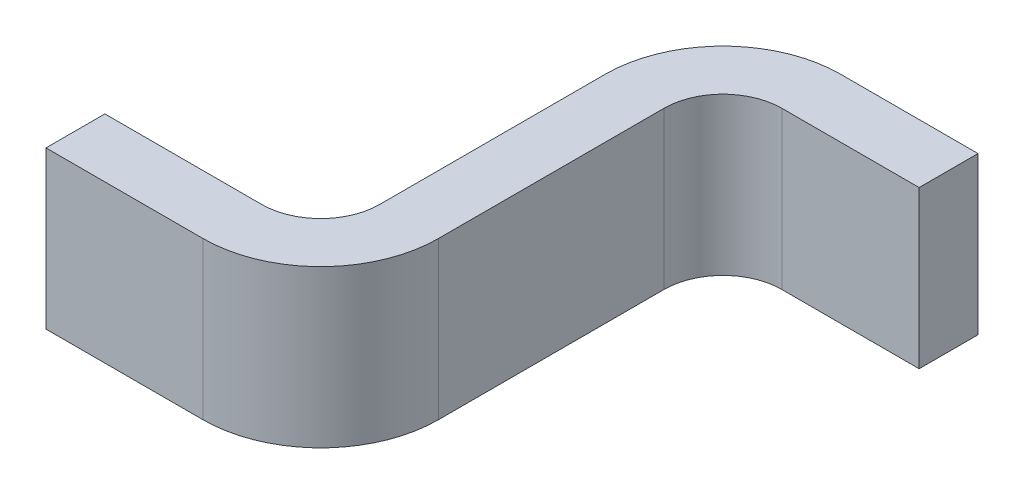
ISO-10303-21;
HEADER;
FILE_DESCRIPTION(('STEP AP214'),'2;1');
FILE_NAME('part.step','',(''),(''),'','','');
FILE_SCHEMA(('AUTOMOTIVE_DESIGN { 1 0 10303 214 1 1 1 1 }'));
ENDSEC;
DATA;
#1=APPLICATION_CONTEXT('core data for automotive mechanical design processes');
#2=APPLICATION_PROTOCOL_DEFINITION('international standard','automotive_design',2000,#1);
#3=PRODUCT_CONTEXT('',#1,'mechanical');
#4=PRODUCT('Part','Part','',(#3));
#5=PRODUCT_RELATED_PRODUCT_CATEGORY('part','',(#4));
#6=PRODUCT_DEFINITION_FORMATION('','',#4);
#7=PRODUCT_DEFINITION_CONTEXT('part definition',#1,'design');
#8=PRODUCT_DEFINITION('design','',#6,#7);
#9=PRODUCT_DEFINITION_SHAPE('','',#8);
#10=(LENGTH_UNIT() NAMED_UNIT(*) SI_UNIT(.MILLI.,.METRE.));
#11=(NAMED_UNIT(*) PLANE_ANGLE_UNIT() SI_UNIT($,.RADIAN.));
#12=(NAMED_UNIT(*) SI_UNIT($,.STERADIAN.) SOLID_ANGLE_UNIT());
#13=UNCERTAINTY_MEASURE_WITH_UNIT(LENGTH_MEASURE(1.E-05),#10,'distance_accuracy_value','');
#14=(GEOMETRIC_REPRESENTATION_CONTEXT(3) GLOBAL_UNCERTAINTY_ASSIGNED_CONTEXT((#13)) GLOBAL_UNIT_ASSIGNED_CONTEXT((#10,
#11,#12)) REPRESENTATION_CONTEXT('',''));
#15=CARTESIAN_POINT('',(0.,0.,0.));
#16=DIRECTION('',(0.,0.,1.));
#17=DIRECTION('',(1.,0.,0.));
#18=AXIS2_PLACEMENT_3D('',#15,#16,#17);
#19=CARTESIAN_POINT('',(3.15,-1.07,0.));
#20=DIRECTION('',(0.,1.,0.));
#21=DIRECTION('',(1.,0.,0.));
#22=AXIS2_PLACEMENT_3D('',#19,#20,#21);
#23=PLANE('',#22);
#24=CARTESIAN_POINT('',(3.05,-1.07,0.3));
#25=DIRECTION('',(0.,-1.,0.));
#26=DIRECTION('',(0.,0.,-1.));
#27=AXIS2_PLACEMENT_3D('',#24,#25,#26);
#28=CIRCLE('',#27,0.15);
#29=CARTESIAN_POINT('',(2.9,-1.07,0.3));
#30=VERTEX_POINT('',#29);
#31=CARTESIAN_POINT('',(3.05,-1.07,0.15));
#32=VERTEX_POINT('',#31);
#33=EDGE_CURVE('E209',#30,#32,#28,.T.);
#34=ORIENTED_EDGE('',*,*,#33,.T.);
#35=DIRECTION('',(-1.,0.,0.));
#36=VECTOR('',#35,1.);
#37=CARTESIAN_POINT('',(0.,-1.07,0.15));
#38=LINE('',#37,#36);
#39=CARTESIAN_POINT('',(3.4,-1.07,0.15));
#40=VERTEX_POINT('',#39);
#41=EDGE_CURVE('E250',#40,#32,#38,.T.);
#42=ORIENTED_EDGE('',*,*,#41,.F.);
#43=DIRECTION('',(0.,0.,1.));
#44=VECTOR('',#43,1.);
#45=CARTESIAN_POINT('',(3.4,-1.07,0.));
#46=LINE('',#45,#44);
#47=CARTESIAN_POINT('',(3.4,-1.07,0.));
#48=VERTEX_POINT('',#47);
#49=EDGE_CURVE('E163',#48,#40,#46,.T.);
#50=ORIENTED_EDGE('',*,*,#49,.F.);
#51=DIRECTION('',(-1.,0.,0.));
#52=VECTOR('',#51,1.);
#53=CARTESIAN_POINT('',(-2.475,-1.07,0.));
#54=LINE('',#53,#52);
#55=CARTESIAN_POINT('',(3.05,-1.07,0.));
#56=VERTEX_POINT('',#55);
#57=EDGE_CURVE('E273',#48,#56,#54,.T.);
#58=ORIENTED_EDGE('',*,*,#57,.T.);
#59=CARTESIAN_POINT('',(3.05,-1.07,0.3));
#60=DIRECTION('',(0.,-1.,0.));
#61=DIRECTION('',(0.,0.,-1.));
#62=AXIS2_PLACEMENT_3D('',#59,#60,#61);
#63=CIRCLE('',#62,0.3);
#64=CARTESIAN_POINT('',(2.75,-1.07,0.3));
#65=VERTEX_POINT('',#64);
#66=EDGE_CURVE('E20',#65,#56,#63,.T.);
#67=ORIENTED_EDGE('',*,*,#66,.F.);
#68=DIRECTION('',(0.,0.,-1.));
#69=VECTOR('',#68,1.);
#70=CARTESIAN_POINT('',(2.75,-1.07,1.175));
#71=LINE('',#70,#69);
#72=CARTESIAN_POINT('',(2.75,-1.07,0.875));
#73=VERTEX_POINT('',#72);
#74=EDGE_CURVE('E188',#73,#65,#71,.T.);
#75=ORIENTED_EDGE('',*,*,#74,.F.);
#76=CARTESIAN_POINT('',(2.6,-1.07,0.875));
#77=DIRECTION('',(0.,-1.,0.));
#78=DIRECTION('',(0.,0.,1.));
#79=AXIS2_PLACEMENT_3D('',#76,#77,#78);
#80=CIRCLE('',#79,0.15);
#81=CARTESIAN_POINT('',(2.6,-1.07,1.025));
#82=VERTEX_POINT('',#81);
#83=EDGE_CURVE('E183',#73,#82,#80,.T.);
#84=ORIENTED_EDGE('',*,*,#83,.T.);
#85=DIRECTION('',(-1.,0.,0.));
#86=VECTOR('',#85,1.);
#87=CARTESIAN_POINT('',(0.,-1.07,1.025));
#88=LINE('',#87,#86);
#89=CARTESIAN_POINT('',(2.2,-1.07,1.025));
#90=VERTEX_POINT('',#89);
#91=EDGE_CURVE('E239',#82,#90,#88,.T.);
#92=ORIENTED_EDGE('',*,*,#91,.T.);
#93=DIRECTION('',(0.,0.,-1.));
#94=VECTOR('',#93,1.);
#95=CARTESIAN_POINT('',(2.2,-1.07,1.1));
#96=LINE('',#95,#94);
#97=CARTESIAN_POINT('',(2.2,-1.07,1.175));
#98=VERTEX_POINT('',#97);
#99=EDGE_CURVE('E27',#98,#90,#96,.T.);
#100=ORIENTED_EDGE('',*,*,#99,.F.);
#101=DIRECTION('',(-1.,0.,0.));
#102=VECTOR('',#101,1.);
#103=CARTESIAN_POINT('',(0.,-1.07,1.175));
#104=LINE('',#103,#102);
#105=CARTESIAN_POINT('',(2.6,-1.07,1.175));
#106=VERTEX_POINT('',#105);
#107=EDGE_CURVE('E11',#106,#98,#104,.T.);
#108=ORIENTED_EDGE('',*,*,#107,.F.);
#109=CARTESIAN_POINT('',(2.6,-1.07,0.875));
#110=DIRECTION('',(0.,-1.,0.));
#111=DIRECTION('',(0.,0.,-1.));
#112=AXIS2_PLACEMENT_3D('',#109,#110,#111);
#113=CIRCLE('',#112,0.3);
#114=CARTESIAN_POINT('',(2.9,-1.07,0.875));
#115=VERTEX_POINT('',#114);
#116=EDGE_CURVE('E135',#115,#106,#113,.T.);
#117=ORIENTED_EDGE('',*,*,#116,.F.);
#118=DIRECTION('',(0.,0.,1.));
#119=VECTOR('',#118,1.);
#120=CARTESIAN_POINT('',(2.9,-1.07,1.175));
#121=LINE('',#120,#119);
#122=EDGE_CURVE('E202',#30,#115,#121,.T.);
#123=ORIENTED_EDGE('',*,*,#122,.F.);
#124=EDGE_LOOP('',(#34,#42,#50,#58,#67,#75,#84,#92,#100,#108,#117,#123));
#125=FACE_BOUND('',#124,.T.);
#126=ADVANCED_FACE('F16',(#125),#23,.T.);
#127=CARTESIAN_POINT('',(0.,0.,1.175));
#128=DIRECTION('',(0.,0.,1.));
#129=DIRECTION('',(1.,0.,0.));
#130=AXIS2_PLACEMENT_3D('',#127,#128,#129);
#131=PLANE('',#130);
#132=DIRECTION('',(0.,1.,0.));
#133=VECTOR('',#132,1.);
#134=CARTESIAN_POINT('',(2.2,-1.27,1.175));
#135=LINE('',#134,#133);
#136=CARTESIAN_POINT('',(2.2,-1.47,1.175));
#137=VERTEX_POINT('',#136);
#138=EDGE_CURVE('E142',#137,#98,#135,.T.);
#139=ORIENTED_EDGE('',*,*,#138,.F.);
#140=DIRECTION('',(-1.,0.,0.));
#141=VECTOR('',#140,1.);
#142=CARTESIAN_POINT('',(2.825,-1.47,1.175));
#143=LINE('',#142,#141);
#144=CARTESIAN_POINT('',(2.6,-1.47,1.175));
#145=VERTEX_POINT('',#144);
#146=EDGE_CURVE('E140',#145,#137,#143,.T.);
#147=ORIENTED_EDGE('',*,*,#146,.F.);
#148=DIRECTION('',(0.,1.,0.));
#149=VECTOR('',#148,1.);
#150=CARTESIAN_POINT('',(2.6,0.,1.175));
#151=LINE('',#150,#149);
#152=EDGE_CURVE('E127',#145,#106,#151,.T.);
#153=ORIENTED_EDGE('',*,*,#152,.T.);
#154=ORIENTED_EDGE('',*,*,#107,.T.);
#155=EDGE_LOOP('',(#139,#147,#153,#154));
#156=FACE_BOUND('',#155,.T.);
#157=ADVANCED_FACE('F18',(#156),#131,.T.);
#158=CARTESIAN_POINT('',(2.2,-1.27,1.1));
#159=DIRECTION('',(-1.,0.,0.));
#160=DIRECTION('',(0.,0.,1.));
#161=AXIS2_PLACEMENT_3D('',#158,#159,#160);
#162=PLANE('',#161);
#163=ORIENTED_EDGE('',*,*,#138,.T.);
#164=ORIENTED_EDGE('',*,*,#99,.T.);
#165=DIRECTION('',(0.,-1.,0.));
#166=VECTOR('',#165,1.);
#167=CARTESIAN_POINT('',(2.2,0.,1.025));
#168=LINE('',#167,#166);
#169=CARTESIAN_POINT('',(2.2,-1.47,1.025));
#170=VERTEX_POINT('',#169);
#171=EDGE_CURVE('E236',#90,#170,#168,.T.);
#172=ORIENTED_EDGE('',*,*,#171,.T.);
#173=DIRECTION('',(0.,0.,-1.));
#174=VECTOR('',#173,1.);
#175=CARTESIAN_POINT('',(2.2,-1.47,1.175));
#176=LINE('',#175,#174);
#177=EDGE_CURVE('E147',#137,#170,#176,.T.);
#178=ORIENTED_EDGE('',*,*,#177,.F.);
#179=EDGE_LOOP('',(#163,#164,#172,#178));
#180=FACE_BOUND('',#179,.T.);
#181=ADVANCED_FACE('F387',(#180),#162,.T.);
#182=CARTESIAN_POINT('',(0.,0.,1.025));
#183=DIRECTION('',(0.,0.,1.));
#184=DIRECTION('',(1.,0.,0.));
#185=AXIS2_PLACEMENT_3D('',#182,#183,#184);
#186=PLANE('',#185);
#187=DIRECTION('',(1.,0.,0.));
#188=VECTOR('',#187,1.);
#189=CARTESIAN_POINT('',(2.825,-1.47,1.025));
#190=LINE('',#189,#188);
#191=CARTESIAN_POINT('',(2.6,-1.47,1.025));
#192=VERTEX_POINT('',#191);
#193=EDGE_CURVE('E172',#170,#192,#190,.T.);
#194=ORIENTED_EDGE('',*,*,#193,.F.);
#195=ORIENTED_EDGE('',*,*,#171,.F.);
#196=ORIENTED_EDGE('',*,*,#91,.F.);
#197=DIRECTION('',(0.,-1.,0.));
#198=VECTOR('',#197,1.);
#199=CARTESIAN_POINT('',(2.6,-0.635,1.025));
#200=LINE('',#199,#198);
#201=EDGE_CURVE('E187',#82,#192,#200,.T.);
#202=ORIENTED_EDGE('',*,*,#201,.T.);
#203=EDGE_LOOP('',(#194,#195,#196,#202));
#204=FACE_BOUND('',#203,.T.);
#205=ADVANCED_FACE('F355',(#204),#186,.F.);
#206=CARTESIAN_POINT('',(2.6,-0.635,0.875));
#207=DIRECTION('',(0.,1.,0.));
#208=DIRECTION('',(0.,0.,1.));
#209=AXIS2_PLACEMENT_3D('',#206,#207,#208);
#210=CYLINDRICAL_SURFACE('',#209,0.15);
#211=ORIENTED_EDGE('',*,*,#83,.F.);
#212=DIRECTION('',(0.,1.,0.));
#213=VECTOR('',#212,1.);
#214=CARTESIAN_POINT('',(2.75,-1.27,0.875));
#215=LINE('',#214,#213);
#216=CARTESIAN_POINT('',(2.75,-1.47,0.875));
#217=VERTEX_POINT('',#216);
#218=EDGE_CURVE('E230',#217,#73,#215,.T.);
#219=ORIENTED_EDGE('',*,*,#218,.F.);
#220=CARTESIAN_POINT('',(2.6,-1.47,0.875));
#221=DIRECTION('',(0.,1.,0.));
#222=DIRECTION('',(0.,0.,1.));
#223=AXIS2_PLACEMENT_3D('',#220,#221,#222);
#224=CIRCLE('',#223,0.15);
#225=EDGE_CURVE('E198',#192,#217,#224,.T.);
#226=ORIENTED_EDGE('',*,*,#225,.F.);
#227=ORIENTED_EDGE('',*,*,#201,.F.);
#228=EDGE_LOOP('',(#211,#219,#226,#227));
#229=FACE_BOUND('',#228,.T.);
#230=ADVANCED_FACE('F351',(#229),#210,.F.);
#231=CARTESIAN_POINT('',(2.75,-1.27,1.175));
#232=DIRECTION('',(-1.,0.,0.));
#233=DIRECTION('',(0.,0.,1.));
#234=AXIS2_PLACEMENT_3D('',#231,#232,#233);
#235=PLANE('',#234);
#236=ORIENTED_EDGE('',*,*,#218,.T.);
#237=ORIENTED_EDGE('',*,*,#74,.T.);
#238=DIRECTION('',(0.,1.,0.));
#239=VECTOR('',#238,1.);
#240=CARTESIAN_POINT('',(2.75,0.,0.3));
#241=LINE('',#240,#239);
#242=CARTESIAN_POINT('',(2.75,-1.47,0.3));
#243=VERTEX_POINT('',#242);
#244=EDGE_CURVE('E173',#243,#65,#241,.T.);
#245=ORIENTED_EDGE('',*,*,#244,.F.);
#246=DIRECTION('',(0.,0.,-1.));
#247=VECTOR('',#246,1.);
#248=CARTESIAN_POINT('',(2.75,-1.47,1.175));
#249=LINE('',#248,#247);
#250=EDGE_CURVE('E223',#217,#243,#249,.T.);
#251=ORIENTED_EDGE('',*,*,#250,.F.);
#252=EDGE_LOOP('',(#236,#237,#245,#251));
#253=FACE_BOUND('',#252,.T.);
#254=ADVANCED_FACE('F323',(#253),#235,.T.);
#255=CARTESIAN_POINT('',(3.05,0.,0.3));
#256=DIRECTION('',(0.,-1.,0.));
#257=DIRECTION('',(0.,0.,-1.));
#258=AXIS2_PLACEMENT_3D('',#255,#256,#257);
#259=CYLINDRICAL_SURFACE('',#258,0.3);
#260=DIRECTION('',(0.,-1.,0.));
#261=VECTOR('',#260,1.);
#262=CARTESIAN_POINT('',(3.05,1.27,0.));
#263=LINE('',#262,#261);
#264=CARTESIAN_POINT('',(3.05,-1.47,0.));
#265=VERTEX_POINT('',#264);
#266=EDGE_CURVE('E177',#56,#265,#263,.T.);
#267=ORIENTED_EDGE('',*,*,#266,.T.);
#268=CARTESIAN_POINT('',(3.05,-1.47,0.3));
#269=DIRECTION('',(0.,-1.,0.));
#270=DIRECTION('',(0.,0.,-1.));
#271=AXIS2_PLACEMENT_3D('',#268,#269,#270);
#272=CIRCLE('',#271,0.3);
#273=EDGE_CURVE('E225',#243,#265,#272,.T.);
#274=ORIENTED_EDGE('',*,*,#273,.F.);
#275=ORIENTED_EDGE('',*,*,#244,.T.);
#276=ORIENTED_EDGE('',*,*,#66,.T.);
#277=EDGE_LOOP('',(#267,#274,#275,#276));
#278=FACE_BOUND('',#277,.T.);
#279=ADVANCED_FACE('F297',(#278),#259,.T.);
#280=CARTESIAN_POINT('',(-2.475,1.27,0.));
#281=DIRECTION('',(0.,0.,1.));
#282=DIRECTION('',(1.,0.,0.));
#283=AXIS2_PLACEMENT_3D('',#280,#281,#282);
#284=PLANE('',#283);
#285=ORIENTED_EDGE('',*,*,#57,.F.);
#286=DIRECTION('',(0.,1.,0.));
#287=VECTOR('',#286,1.);
#288=CARTESIAN_POINT('',(3.4,-1.27,0.));
#289=LINE('',#288,#287);
#290=CARTESIAN_POINT('',(3.4,-1.47,0.));
#291=VERTEX_POINT('',#290);
#292=EDGE_CURVE('E222',#291,#48,#289,.T.);
#293=ORIENTED_EDGE('',*,*,#292,.F.);
#294=DIRECTION('',(1.,0.,0.));
#295=VECTOR('',#294,1.);
#296=CARTESIAN_POINT('',(2.825,-1.47,0.));
#297=LINE('',#296,#295);
#298=EDGE_CURVE('E169',#265,#291,#297,.T.);
#299=ORIENTED_EDGE('',*,*,#298,.F.);
#300=ORIENTED_EDGE('',*,*,#266,.F.);
#301=EDGE_LOOP('',(#285,#293,#299,#300));
#302=FACE_BOUND('',#301,.T.);
#303=ADVANCED_FACE('F295',(#302),#284,.F.);
#304=CARTESIAN_POINT('',(3.4,-1.27,0.));
#305=DIRECTION('',(1.,0.,0.));
#306=DIRECTION('',(0.,1.,0.));
#307=AXIS2_PLACEMENT_3D('',#304,#305,#306);
#308=PLANE('',#307);
#309=ORIENTED_EDGE('',*,*,#292,.T.);
#310=ORIENTED_EDGE('',*,*,#49,.T.);
#311=DIRECTION('',(0.,1.,0.));
#312=VECTOR('',#311,1.);
#313=CARTESIAN_POINT('',(3.4,0.,0.15));
#314=LINE('',#313,#312);
#315=CARTESIAN_POINT('',(3.4,-1.47,0.15));
#316=VERTEX_POINT('',#315);
#317=EDGE_CURVE('E229',#316,#40,#314,.T.);
#318=ORIENTED_EDGE('',*,*,#317,.F.);
#319=DIRECTION('',(0.,0.,1.));
#320=VECTOR('',#319,1.);
#321=CARTESIAN_POINT('',(3.4,-1.47,1.175));
#322=LINE('',#321,#320);
#323=EDGE_CURVE('E165',#291,#316,#322,.T.);
#324=ORIENTED_EDGE('',*,*,#323,.F.);
#325=EDGE_LOOP('',(#309,#310,#318,#324));
#326=FACE_BOUND('',#325,.T.);
#327=ADVANCED_FACE('F284',(#326),#308,.T.);
#328=CARTESIAN_POINT('',(0.,0.,0.15));
#329=DIRECTION('',(0.,0.,1.));
#330=DIRECTION('',(1.,0.,0.));
#331=AXIS2_PLACEMENT_3D('',#328,#329,#330);
#332=PLANE('',#331);
#333=ORIENTED_EDGE('',*,*,#317,.T.);
#334=ORIENTED_EDGE('',*,*,#41,.T.);
#335=DIRECTION('',(0.,-1.,0.));
#336=VECTOR('',#335,1.);
#337=CARTESIAN_POINT('',(3.05,-0.635,0.15));
#338=LINE('',#337,#336);
#339=CARTESIAN_POINT('',(3.05,-1.47,0.15));
#340=VERTEX_POINT('',#339);
#341=EDGE_CURVE('E218',#32,#340,#338,.T.);
#342=ORIENTED_EDGE('',*,*,#341,.T.);
#343=DIRECTION('',(-1.,0.,0.));
#344=VECTOR('',#343,1.);
#345=CARTESIAN_POINT('',(2.825,-1.47,0.15));
#346=LINE('',#345,#344);
#347=EDGE_CURVE('E168',#316,#340,#346,.T.);
#348=ORIENTED_EDGE('',*,*,#347,.F.);
#349=EDGE_LOOP('',(#333,#334,#342,#348));
#350=FACE_BOUND('',#349,.T.);
#351=ADVANCED_FACE('F290',(#350),#332,.T.);
#352=CARTESIAN_POINT('',(3.05,-0.635,0.3));
#353=DIRECTION('',(0.,-1.,0.));
#354=DIRECTION('',(0.,0.,-1.));
#355=AXIS2_PLACEMENT_3D('',#352,#353,#354);
#356=CYLINDRICAL_SURFACE('',#355,0.15);
#357=ORIENTED_EDGE('',*,*,#33,.F.);
#358=DIRECTION('',(0.,1.,0.));
#359=VECTOR('',#358,1.);
#360=CARTESIAN_POINT('',(2.9,-1.27,0.3));
#361=LINE('',#360,#359);
#362=CARTESIAN_POINT('',(2.9,-1.47,0.3));
#363=VERTEX_POINT('',#362);
#364=EDGE_CURVE('E137',#363,#30,#361,.T.);
#365=ORIENTED_EDGE('',*,*,#364,.F.);
#366=CARTESIAN_POINT('',(3.05,-1.47,0.3));
#367=DIRECTION('',(0.,1.,0.));
#368=DIRECTION('',(0.,0.,-1.));
#369=AXIS2_PLACEMENT_3D('',#366,#367,#368);
#370=CIRCLE('',#369,0.15);
#371=EDGE_CURVE('E192',#340,#363,#370,.T.);
#372=ORIENTED_EDGE('',*,*,#371,.F.);
#373=ORIENTED_EDGE('',*,*,#341,.F.);
#374=EDGE_LOOP('',(#357,#365,#372,#373));
#375=FACE_BOUND('',#374,.T.);
#376=ADVANCED_FACE('F288',(#375),#356,.F.);
#377=CARTESIAN_POINT('',(2.9,-1.27,1.175));
#378=DIRECTION('',(1.,0.,0.));
#379=DIRECTION('',(0.,1.,0.));
#380=AXIS2_PLACEMENT_3D('',#377,#378,#379);
#381=PLANE('',#380);
#382=DIRECTION('',(0.,1.,0.));
#383=VECTOR('',#382,1.);
#384=CARTESIAN_POINT('',(2.9,-0.635,0.875));
#385=LINE('',#384,#383);
#386=CARTESIAN_POINT('',(2.9,-1.47,0.875));
#387=VERTEX_POINT('',#386);
#388=EDGE_CURVE('E180',#387,#115,#385,.T.);
#389=ORIENTED_EDGE('',*,*,#388,.F.);
#390=DIRECTION('',(0.,0.,1.));
#391=VECTOR('',#390,1.);
#392=CARTESIAN_POINT('',(2.9,-1.47,1.175));
#393=LINE('',#392,#391);
#394=EDGE_CURVE('E152',#363,#387,#393,.T.);
#395=ORIENTED_EDGE('',*,*,#394,.F.);
#396=ORIENTED_EDGE('',*,*,#364,.T.);
#397=ORIENTED_EDGE('',*,*,#122,.T.);
#398=EDGE_LOOP('',(#389,#395,#396,#397));
#399=FACE_BOUND('',#398,.T.);
#400=ADVANCED_FACE('F311',(#399),#381,.T.);
#401=CARTESIAN_POINT('',(2.6,-0.635,0.875));
#402=DIRECTION('',(0.,-1.,0.));
#403=DIRECTION('',(0.,0.,-1.));
#404=AXIS2_PLACEMENT_3D('',#401,#402,#403);
#405=CYLINDRICAL_SURFACE('',#404,0.3);
#406=ORIENTED_EDGE('',*,*,#388,.T.);
#407=ORIENTED_EDGE('',*,*,#116,.T.);
#408=ORIENTED_EDGE('',*,*,#152,.F.);
#409=CARTESIAN_POINT('',(2.6,-1.47,0.875));
#410=DIRECTION('',(0.,-1.,0.));
#411=DIRECTION('',(0.,0.,-1.));
#412=AXIS2_PLACEMENT_3D('',#409,#410,#411);
#413=CIRCLE('',#412,0.3);
#414=EDGE_CURVE('E132',#387,#145,#413,.T.);
#415=ORIENTED_EDGE('',*,*,#414,.F.);
#416=EDGE_LOOP('',(#406,#407,#408,#415));
#417=FACE_BOUND('',#416,.T.);
#418=ADVANCED_FACE('F130',(#417),#405,.T.);
#419=CARTESIAN_POINT('',(2.825,-1.47,1.175));
#420=DIRECTION('',(0.,-1.,0.));
#421=DIRECTION('',(0.,0.,-1.));
#422=AXIS2_PLACEMENT_3D('',#419,#420,#421);
#423=PLANE('',#422);
#424=ORIENTED_EDGE('',*,*,#394,.T.);
#425=ORIENTED_EDGE('',*,*,#414,.T.);
#426=ORIENTED_EDGE('',*,*,#146,.T.);
#427=ORIENTED_EDGE('',*,*,#177,.T.);
#428=ORIENTED_EDGE('',*,*,#193,.T.);
#429=ORIENTED_EDGE('',*,*,#225,.T.);
#430=ORIENTED_EDGE('',*,*,#250,.T.);
#431=ORIENTED_EDGE('',*,*,#273,.T.);
#432=ORIENTED_EDGE('',*,*,#298,.T.);
#433=ORIENTED_EDGE('',*,*,#323,.T.);
#434=ORIENTED_EDGE('',*,*,#347,.T.);
#435=ORIENTED_EDGE('',*,*,#371,.T.);
#436=EDGE_LOOP('',(#424,#425,#426,#427,#428,#429,#430,#431,#432,#433,#434,#435));
#437=FACE_BOUND('',#436,.T.);
#438=ADVANCED_FACE('F149',(#437),#423,.T.);
#439=CLOSED_SHELL('',(#126,#157,#181,#205,#230,#254,#279,#303,#327,#351,#376,#400,#418,#438));
#440=MANIFOLD_SOLID_BREP('B1',#439);
#441=ADVANCED_BREP_SHAPE_REPRESENTATION('',(#18,#440),#14);
#442=SHAPE_DEFINITION_REPRESENTATION(#9,#441);
ENDSEC;
END-ISO-10303-21;
